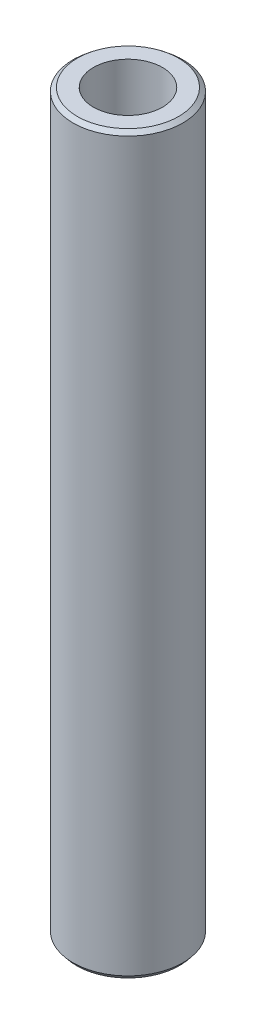
ISO-10303-21;
HEADER;
FILE_DESCRIPTION(('STEP AP214'),'2;1');
FILE_NAME('part.step','',(''),(''),'','','');
FILE_SCHEMA(('AUTOMOTIVE_DESIGN { 1 0 10303 214 1 1 1 1 }'));
ENDSEC;
DATA;
#1=APPLICATION_CONTEXT('core data for automotive mechanical design processes');
#2=APPLICATION_PROTOCOL_DEFINITION('international standard','automotive_design',2000,#1);
#3=PRODUCT_CONTEXT('',#1,'mechanical');
#4=PRODUCT('Part','Part','',(#3));
#5=PRODUCT_RELATED_PRODUCT_CATEGORY('part','',(#4));
#6=PRODUCT_DEFINITION_FORMATION('','',#4);
#7=PRODUCT_DEFINITION_CONTEXT('part definition',#1,'design');
#8=PRODUCT_DEFINITION('design','',#6,#7);
#9=PRODUCT_DEFINITION_SHAPE('','',#8);
#10=(LENGTH_UNIT() NAMED_UNIT(*) SI_UNIT(.MILLI.,.METRE.));
#11=(NAMED_UNIT(*) PLANE_ANGLE_UNIT() SI_UNIT($,.RADIAN.));
#12=(NAMED_UNIT(*) SI_UNIT($,.STERADIAN.) SOLID_ANGLE_UNIT());
#13=UNCERTAINTY_MEASURE_WITH_UNIT(LENGTH_MEASURE(1.E-05),#10,'distance_accuracy_value','');
#14=(GEOMETRIC_REPRESENTATION_CONTEXT(3) GLOBAL_UNCERTAINTY_ASSIGNED_CONTEXT((#13)) GLOBAL_UNIT_ASSIGNED_CONTEXT((#10,
#11,#12)) REPRESENTATION_CONTEXT('',''));
#15=CARTESIAN_POINT('',(0.,0.,0.));
#16=DIRECTION('',(0.,0.,1.));
#17=DIRECTION('',(1.,0.,0.));
#18=AXIS2_PLACEMENT_3D('',#15,#16,#17);
#19=CARTESIAN_POINT('',(0.,468.722640156522,0.));
#20=DIRECTION('',(0.,-1.,0.));
#21=DIRECTION('',(0.,0.,-1.));
#22=AXIS2_PLACEMENT_3D('',#19,#20,#21);
#23=CYLINDRICAL_SURFACE('',#22,35.);
#24=CARTESIAN_POINT('',(0.,466.504677259389,0.));
#25=DIRECTION('',(0.,1.,0.));
#26=DIRECTION('',(0.,0.,1.));
#27=AXIS2_PLACEMENT_3D('',#24,#25,#26);
#28=CIRCLE('',#27,35.);
#29=CARTESIAN_POINT('',(0.,466.504677259389,35.));
#30=VERTEX_POINT('',#29);
#31=EDGE_CURVE('E50',#30,#30,#28,.F.);
#32=ORIENTED_EDGE('',*,*,#31,.T.);
#33=EDGE_LOOP('',(#32));
#34=FACE_BOUND('',#33,.T.);
#35=CARTESIAN_POINT('',(0.,2.72610352856467,0.));
#36=DIRECTION('',(0.,1.,0.));
#37=DIRECTION('',(0.,0.,1.));
#38=AXIS2_PLACEMENT_3D('',#35,#36,#37);
#39=CIRCLE('',#38,35.);
#40=CARTESIAN_POINT('',(0.,2.72610352856467,35.));
#41=VERTEX_POINT('',#40);
#42=EDGE_CURVE('E51',#41,#41,#39,.T.);
#43=ORIENTED_EDGE('',*,*,#42,.T.);
#44=EDGE_LOOP('',(#43));
#45=FACE_BOUND('',#44,.T.);
#46=ADVANCED_FACE('F39',(#34,#45),#23,.T.);
#47=CARTESIAN_POINT('',(0.,468.722640156522,0.));
#48=DIRECTION('',(0.,1.,0.));
#49=DIRECTION('',(0.,0.,1.));
#50=AXIS2_PLACEMENT_3D('',#47,#48,#49);
#51=PLANE('',#50);
#52=CARTESIAN_POINT('',(0.,468.722640156522,0.));
#53=DIRECTION('',(0.,1.,0.));
#54=DIRECTION('',(0.,0.,1.));
#55=AXIS2_PLACEMENT_3D('',#52,#53,#54);
#56=CIRCLE('',#55,32.2738964714355);
#57=CARTESIAN_POINT('',(0.,468.722640156522,32.2738964714355));
#58=VERTEX_POINT('',#57);
#59=EDGE_CURVE('E54',#58,#58,#56,.T.);
#60=ORIENTED_EDGE('',*,*,#59,.T.);
#61=EDGE_LOOP('',(#60));
#62=FACE_BOUND('',#61,.T.);
#63=CARTESIAN_POINT('',(0.,468.722640156522,0.));
#64=DIRECTION('',(0.,1.,0.));
#65=DIRECTION('',(0.,0.,1.));
#66=AXIS2_PLACEMENT_3D('',#63,#64,#65);
#67=CIRCLE('',#66,22.0039067385522);
#68=CARTESIAN_POINT('',(0.,468.722640156522,22.0039067385522));
#69=VERTEX_POINT('',#68);
#70=EDGE_CURVE('E58',#69,#69,#67,.T.);
#71=ORIENTED_EDGE('',*,*,#70,.F.);
#72=EDGE_LOOP('',(#71));
#73=FACE_BOUND('',#72,.T.);
#74=ADVANCED_FACE('F69',(#62,#73),#51,.T.);
#75=CARTESIAN_POINT('',(0.,0.,0.));
#76=DIRECTION('',(0.,1.,0.));
#77=DIRECTION('',(0.,0.,1.));
#78=AXIS2_PLACEMENT_3D('',#75,#76,#77);
#79=PLANE('',#78);
#80=CARTESIAN_POINT('',(0.,0.,0.));
#81=DIRECTION('',(0.,1.,0.));
#82=DIRECTION('',(0.,0.,1.));
#83=AXIS2_PLACEMENT_3D('',#80,#81,#82);
#84=CIRCLE('',#83,32.7820371028668);
#85=CARTESIAN_POINT('',(0.,0.,32.7820371028668));
#86=VERTEX_POINT('',#85);
#87=EDGE_CURVE('E10',#86,#86,#84,.F.);
#88=ORIENTED_EDGE('',*,*,#87,.T.);
#89=EDGE_LOOP('',(#88));
#90=FACE_BOUND('',#89,.T.);
#91=CARTESIAN_POINT('',(0.,0.,0.));
#92=DIRECTION('',(0.,1.,0.));
#93=DIRECTION('',(0.,0.,1.));
#94=AXIS2_PLACEMENT_3D('',#91,#92,#93);
#95=CIRCLE('',#94,22.0039067385522);
#96=CARTESIAN_POINT('',(0.,0.,22.0039067385522));
#97=VERTEX_POINT('',#96);
#98=EDGE_CURVE('E63',#97,#97,#95,.T.);
#99=ORIENTED_EDGE('',*,*,#98,.T.);
#100=EDGE_LOOP('',(#99));
#101=FACE_BOUND('',#100,.T.);
#102=ADVANCED_FACE('F75',(#90,#101),#79,.F.);
#103=CARTESIAN_POINT('',(0.,468.722640156522,0.));
#104=DIRECTION('',(0.,-1.,0.));
#105=DIRECTION('',(0.,0.,-1.));
#106=AXIS2_PLACEMENT_3D('',#103,#104,#105);
#107=CYLINDRICAL_SURFACE('',#106,22.0039067385522);
#108=ORIENTED_EDGE('',*,*,#70,.T.);
#109=EDGE_LOOP('',(#108));
#110=FACE_BOUND('',#109,.T.);
#111=ORIENTED_EDGE('',*,*,#98,.F.);
#112=EDGE_LOOP('',(#111));
#113=FACE_BOUND('',#112,.T.);
#114=ADVANCED_FACE('F70',(#110,#113),#107,.F.);
#115=CARTESIAN_POINT('',(0.,468.722640156522,0.));
#116=DIRECTION('',(0.,-1.,0.));
#117=DIRECTION('',(0.,0.,-1.));
#118=AXIS2_PLACEMENT_3D('',#115,#116,#117);
#119=CONICAL_SURFACE('',#118,32.2738964714355,0.887816422066596);
#120=ORIENTED_EDGE('',*,*,#31,.F.);
#121=EDGE_LOOP('',(#120));
#122=FACE_BOUND('',#121,.T.);
#123=ORIENTED_EDGE('',*,*,#59,.F.);
#124=EDGE_LOOP('',(#123));
#125=FACE_BOUND('',#124,.T.);
#126=ADVANCED_FACE('F81',(#122,#125),#119,.T.);
#127=CARTESIAN_POINT('',(0.,2.72610352856467,0.));
#128=DIRECTION('',(0.,1.,0.));
#129=DIRECTION('',(0.,0.,1.));
#130=AXIS2_PLACEMENT_3D('',#127,#128,#129);
#131=CONICAL_SURFACE('',#130,35.,0.682979904728299);
#132=ORIENTED_EDGE('',*,*,#87,.F.);
#133=EDGE_LOOP('',(#132));
#134=FACE_BOUND('',#133,.T.);
#135=ORIENTED_EDGE('',*,*,#42,.F.);
#136=EDGE_LOOP('',(#135));
#137=FACE_BOUND('',#136,.T.);
#138=ADVANCED_FACE('F45',(#134,#137),#131,.T.);
#139=CLOSED_SHELL('',(#46,#74,#102,#114,#126,#138));
#140=MANIFOLD_SOLID_BREP('B2',#139);
#141=ADVANCED_BREP_SHAPE_REPRESENTATION('',(#18,#140),#14);
#142=SHAPE_DEFINITION_REPRESENTATION(#9,#141);
ENDSEC;
END-ISO-10303-21;
